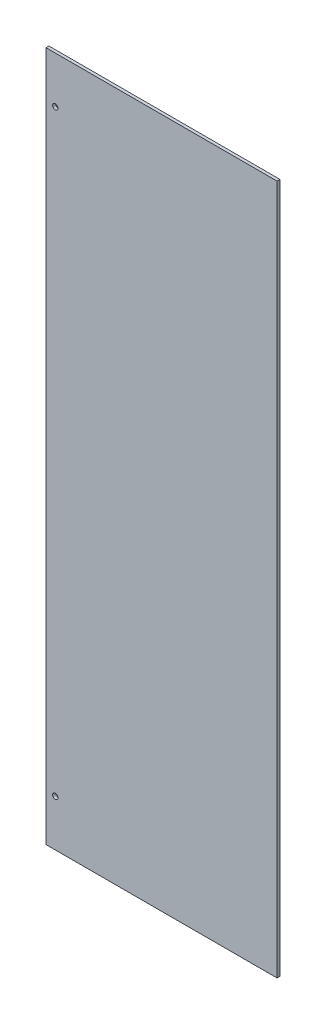
ISO-10303-21;
HEADER;
FILE_DESCRIPTION(('STEP AP214'),'2;1');
FILE_NAME('part.step','',(''),(''),'','','');
FILE_SCHEMA(('AUTOMOTIVE_DESIGN { 1 0 10303 214 1 1 1 1 }'));
ENDSEC;
DATA;
#1=APPLICATION_CONTEXT('core data for automotive mechanical design processes');
#2=APPLICATION_PROTOCOL_DEFINITION('international standard','automotive_design',2000,#1);
#3=PRODUCT_CONTEXT('',#1,'mechanical');
#4=PRODUCT('Part','Part','',(#3));
#5=PRODUCT_RELATED_PRODUCT_CATEGORY('part','',(#4));
#6=PRODUCT_DEFINITION_FORMATION('','',#4);
#7=PRODUCT_DEFINITION_CONTEXT('part definition',#1,'design');
#8=PRODUCT_DEFINITION('design','',#6,#7);
#9=PRODUCT_DEFINITION_SHAPE('','',#8);
#10=(LENGTH_UNIT() NAMED_UNIT(*) SI_UNIT(.MILLI.,.METRE.));
#11=(NAMED_UNIT(*) PLANE_ANGLE_UNIT() SI_UNIT($,.RADIAN.));
#12=(NAMED_UNIT(*) SI_UNIT($,.STERADIAN.) SOLID_ANGLE_UNIT());
#13=UNCERTAINTY_MEASURE_WITH_UNIT(LENGTH_MEASURE(1.E-05),#10,'distance_accuracy_value','');
#14=(GEOMETRIC_REPRESENTATION_CONTEXT(3) GLOBAL_UNCERTAINTY_ASSIGNED_CONTEXT((#13)) GLOBAL_UNIT_ASSIGNED_CONTEXT((#10,
#11,#12)) REPRESENTATION_CONTEXT('',''));
#15=CARTESIAN_POINT('',(0.,0.,0.));
#16=DIRECTION('',(0.,0.,1.));
#17=DIRECTION('',(1.,0.,0.));
#18=AXIS2_PLACEMENT_3D('',#15,#16,#17);
#19=CARTESIAN_POINT('',(0.,0.,1.5875));
#20=DIRECTION('',(1.,0.,0.));
#21=DIRECTION('',(0.,0.,-1.));
#22=AXIS2_PLACEMENT_3D('',#19,#20,#21);
#23=PLANE('',#22);
#24=DIRECTION('',(0.,-1.,0.));
#25=VECTOR('',#24,1.);
#26=CARTESIAN_POINT('',(0.,0.,0.));
#27=LINE('',#26,#25);
#28=CARTESIAN_POINT('',(0.,376.555,0.));
#29=VERTEX_POINT('',#28);
#30=CARTESIAN_POINT('',(0.,0.,0.));
#31=VERTEX_POINT('',#30);
#32=EDGE_CURVE('E99',#29,#31,#27,.T.);
#33=ORIENTED_EDGE('',*,*,#32,.T.);
#34=DIRECTION('',(0.,0.,-1.));
#35=VECTOR('',#34,1.);
#36=CARTESIAN_POINT('',(0.,0.,1.5875));
#37=LINE('',#36,#35);
#38=CARTESIAN_POINT('',(0.,0.,1.5875));
#39=VERTEX_POINT('',#38);
#40=EDGE_CURVE('E11',#39,#31,#37,.T.);
#41=ORIENTED_EDGE('',*,*,#40,.F.);
#42=DIRECTION('',(0.,-1.,0.));
#43=VECTOR('',#42,1.);
#44=CARTESIAN_POINT('',(0.,0.,1.5875));
#45=LINE('',#44,#43);
#46=CARTESIAN_POINT('',(0.,376.555,1.5875));
#47=VERTEX_POINT('',#46);
#48=EDGE_CURVE('E86',#47,#39,#45,.T.);
#49=ORIENTED_EDGE('',*,*,#48,.F.);
#50=DIRECTION('',(0.,0.,-1.));
#51=VECTOR('',#50,1.);
#52=CARTESIAN_POINT('',(0.,376.555,1.5875));
#53=LINE('',#52,#51);
#54=EDGE_CURVE('E95',#47,#29,#53,.T.);
#55=ORIENTED_EDGE('',*,*,#54,.T.);
#56=EDGE_LOOP('',(#33,#41,#49,#55));
#57=FACE_BOUND('',#56,.T.);
#58=ADVANCED_FACE('F33',(#57),#23,.F.);
#59=CARTESIAN_POINT('',(0.,0.,1.5875));
#60=DIRECTION('',(0.,1.,0.));
#61=DIRECTION('',(0.,0.,1.));
#62=AXIS2_PLACEMENT_3D('',#59,#60,#61);
#63=PLANE('',#62);
#64=DIRECTION('',(1.,0.,0.));
#65=VECTOR('',#64,1.);
#66=CARTESIAN_POINT('',(0.,0.,0.));
#67=LINE('',#66,#65);
#68=CARTESIAN_POINT('',(126.0475,0.,0.));
#69=VERTEX_POINT('',#68);
#70=EDGE_CURVE('E90',#31,#69,#67,.T.);
#71=ORIENTED_EDGE('',*,*,#70,.T.);
#72=DIRECTION('',(0.,0.,-1.));
#73=VECTOR('',#72,1.);
#74=CARTESIAN_POINT('',(126.0475,0.,1.5875));
#75=LINE('',#74,#73);
#76=CARTESIAN_POINT('',(126.0475,0.,1.5875));
#77=VERTEX_POINT('',#76);
#78=EDGE_CURVE('E42',#77,#69,#75,.T.);
#79=ORIENTED_EDGE('',*,*,#78,.F.);
#80=DIRECTION('',(1.,0.,0.));
#81=VECTOR('',#80,1.);
#82=CARTESIAN_POINT('',(0.,0.,1.5875));
#83=LINE('',#82,#81);
#84=EDGE_CURVE('E81',#39,#77,#83,.T.);
#85=ORIENTED_EDGE('',*,*,#84,.F.);
#86=ORIENTED_EDGE('',*,*,#40,.T.);
#87=EDGE_LOOP('',(#71,#79,#85,#86));
#88=FACE_BOUND('',#87,.T.);
#89=ADVANCED_FACE('F89',(#88),#63,.F.);
#90=CARTESIAN_POINT('',(126.0475,0.,1.5875));
#91=DIRECTION('',(-1.,0.,0.));
#92=DIRECTION('',(0.,0.,1.));
#93=AXIS2_PLACEMENT_3D('',#90,#91,#92);
#94=PLANE('',#93);
#95=DIRECTION('',(0.,1.,0.));
#96=VECTOR('',#95,1.);
#97=CARTESIAN_POINT('',(126.0475,0.,0.));
#98=LINE('',#97,#96);
#99=CARTESIAN_POINT('',(126.0475,376.555,0.));
#100=VERTEX_POINT('',#99);
#101=EDGE_CURVE('E68',#69,#100,#98,.T.);
#102=ORIENTED_EDGE('',*,*,#101,.T.);
#103=DIRECTION('',(0.,0.,-1.));
#104=VECTOR('',#103,1.);
#105=CARTESIAN_POINT('',(126.0475,376.555,1.5875));
#106=LINE('',#105,#104);
#107=CARTESIAN_POINT('',(126.0475,376.555,1.5875));
#108=VERTEX_POINT('',#107);
#109=EDGE_CURVE('E91',#108,#100,#106,.T.);
#110=ORIENTED_EDGE('',*,*,#109,.F.);
#111=DIRECTION('',(0.,1.,0.));
#112=VECTOR('',#111,1.);
#113=CARTESIAN_POINT('',(126.0475,0.,1.5875));
#114=LINE('',#113,#112);
#115=EDGE_CURVE('E84',#77,#108,#114,.T.);
#116=ORIENTED_EDGE('',*,*,#115,.F.);
#117=ORIENTED_EDGE('',*,*,#78,.T.);
#118=EDGE_LOOP('',(#102,#110,#116,#117));
#119=FACE_BOUND('',#118,.T.);
#120=ADVANCED_FACE('F93',(#119),#94,.F.);
#121=CARTESIAN_POINT('',(0.,376.555,1.5875));
#122=DIRECTION('',(0.,-1.,0.));
#123=DIRECTION('',(0.,0.,-1.));
#124=AXIS2_PLACEMENT_3D('',#121,#122,#123);
#125=PLANE('',#124);
#126=DIRECTION('',(-1.,0.,0.));
#127=VECTOR('',#126,1.);
#128=CARTESIAN_POINT('',(0.,376.555,0.));
#129=LINE('',#128,#127);
#130=EDGE_CURVE('E74',#100,#29,#129,.T.);
#131=ORIENTED_EDGE('',*,*,#130,.T.);
#132=ORIENTED_EDGE('',*,*,#54,.F.);
#133=DIRECTION('',(-1.,0.,0.));
#134=VECTOR('',#133,1.);
#135=CARTESIAN_POINT('',(0.,376.555,1.5875));
#136=LINE('',#135,#134);
#137=EDGE_CURVE('E51',#108,#47,#136,.T.);
#138=ORIENTED_EDGE('',*,*,#137,.F.);
#139=ORIENTED_EDGE('',*,*,#109,.T.);
#140=EDGE_LOOP('',(#131,#132,#138,#139));
#141=FACE_BOUND('',#140,.T.);
#142=ADVANCED_FACE('F126',(#141),#125,.F.);
#143=CARTESIAN_POINT('',(0.,0.,1.5875));
#144=DIRECTION('',(0.,0.,-1.));
#145=DIRECTION('',(-1.,0.,0.));
#146=AXIS2_PLACEMENT_3D('',#143,#144,#145);
#147=PLANE('',#146);
#148=CARTESIAN_POINT('',(5.08,25.4,1.5875));
#149=DIRECTION('',(0.,0.,1.));
#150=DIRECTION('',(1.,0.,0.));
#151=AXIS2_PLACEMENT_3D('',#148,#149,#150);
#152=CIRCLE('',#151,1.4605);
#153=CARTESIAN_POINT('',(6.5405,25.4,1.5875));
#154=VERTEX_POINT('',#153);
#155=EDGE_CURVE('E116',#154,#154,#152,.T.);
#156=ORIENTED_EDGE('',*,*,#155,.F.);
#157=EDGE_LOOP('',(#156));
#158=FACE_BOUND('',#157,.T.);
#159=CARTESIAN_POINT('',(5.08,351.155,1.5875));
#160=DIRECTION('',(0.,0.,1.));
#161=DIRECTION('',(1.,0.,0.));
#162=AXIS2_PLACEMENT_3D('',#159,#160,#161);
#163=CIRCLE('',#162,1.4605);
#164=CARTESIAN_POINT('',(6.5405,351.155,1.5875));
#165=VERTEX_POINT('',#164);
#166=EDGE_CURVE('E108',#165,#165,#163,.T.);
#167=ORIENTED_EDGE('',*,*,#166,.F.);
#168=EDGE_LOOP('',(#167));
#169=FACE_BOUND('',#168,.T.);
#170=ORIENTED_EDGE('',*,*,#48,.T.);
#171=ORIENTED_EDGE('',*,*,#84,.T.);
#172=ORIENTED_EDGE('',*,*,#115,.T.);
#173=ORIENTED_EDGE('',*,*,#137,.T.);
#174=EDGE_LOOP('',(#170,#171,#172,#173));
#175=FACE_BOUND('',#174,.T.);
#176=ADVANCED_FACE('F82',(#158,#169,#175),#147,.F.);
#177=CARTESIAN_POINT('',(0.,0.,0.));
#178=DIRECTION('',(0.,0.,-1.));
#179=DIRECTION('',(-1.,0.,0.));
#180=AXIS2_PLACEMENT_3D('',#177,#178,#179);
#181=PLANE('',#180);
#182=CARTESIAN_POINT('',(5.08,25.4,0.));
#183=DIRECTION('',(0.,0.,-1.));
#184=DIRECTION('',(-1.,0.,0.));
#185=AXIS2_PLACEMENT_3D('',#182,#183,#184);
#186=CIRCLE('',#185,1.4605);
#187=CARTESIAN_POINT('',(3.6195,25.4,0.));
#188=VERTEX_POINT('',#187);
#189=EDGE_CURVE('E36',#188,#188,#186,.T.);
#190=ORIENTED_EDGE('',*,*,#189,.F.);
#191=EDGE_LOOP('',(#190));
#192=FACE_BOUND('',#191,.T.);
#193=CARTESIAN_POINT('',(5.08,351.155,0.));
#194=DIRECTION('',(0.,0.,-1.));
#195=DIRECTION('',(-1.,0.,0.));
#196=AXIS2_PLACEMENT_3D('',#193,#194,#195);
#197=CIRCLE('',#196,1.4605);
#198=CARTESIAN_POINT('',(3.6195,351.155,0.));
#199=VERTEX_POINT('',#198);
#200=EDGE_CURVE('E102',#199,#199,#197,.T.);
#201=ORIENTED_EDGE('',*,*,#200,.F.);
#202=EDGE_LOOP('',(#201));
#203=FACE_BOUND('',#202,.T.);
#204=ORIENTED_EDGE('',*,*,#32,.F.);
#205=ORIENTED_EDGE('',*,*,#130,.F.);
#206=ORIENTED_EDGE('',*,*,#101,.F.);
#207=ORIENTED_EDGE('',*,*,#70,.F.);
#208=EDGE_LOOP('',(#204,#205,#206,#207));
#209=FACE_BOUND('',#208,.T.);
#210=ADVANCED_FACE('F125',(#192,#203,#209),#181,.T.);
#211=CARTESIAN_POINT('',(5.08,351.155,-4.7625));
#212=DIRECTION('',(0.,0.,1.));
#213=DIRECTION('',(1.,0.,0.));
#214=AXIS2_PLACEMENT_3D('',#211,#212,#213);
#215=CYLINDRICAL_SURFACE('',#214,1.4605);
#216=ORIENTED_EDGE('',*,*,#200,.T.);
#217=EDGE_LOOP('',(#216));
#218=FACE_BOUND('',#217,.T.);
#219=ORIENTED_EDGE('',*,*,#166,.T.);
#220=EDGE_LOOP('',(#219));
#221=FACE_BOUND('',#220,.T.);
#222=ADVANCED_FACE('F132',(#218,#221),#215,.F.);
#223=CARTESIAN_POINT('',(5.08,25.4,-4.7625));
#224=DIRECTION('',(0.,0.,1.));
#225=DIRECTION('',(1.,0.,0.));
#226=AXIS2_PLACEMENT_3D('',#223,#224,#225);
#227=CYLINDRICAL_SURFACE('',#226,1.4605);
#228=ORIENTED_EDGE('',*,*,#189,.T.);
#229=EDGE_LOOP('',(#228));
#230=FACE_BOUND('',#229,.T.);
#231=ORIENTED_EDGE('',*,*,#155,.T.);
#232=EDGE_LOOP('',(#231));
#233=FACE_BOUND('',#232,.T.);
#234=ADVANCED_FACE('F121',(#230,#233),#227,.F.);
#235=CLOSED_SHELL('',(#58,#89,#120,#142,#176,#210,#222,#234));
#236=MANIFOLD_SOLID_BREP('B2',#235);
#237=ADVANCED_BREP_SHAPE_REPRESENTATION('',(#18,#236),#14);
#238=SHAPE_DEFINITION_REPRESENTATION(#9,#237);
ENDSEC;
END-ISO-10303-21;
